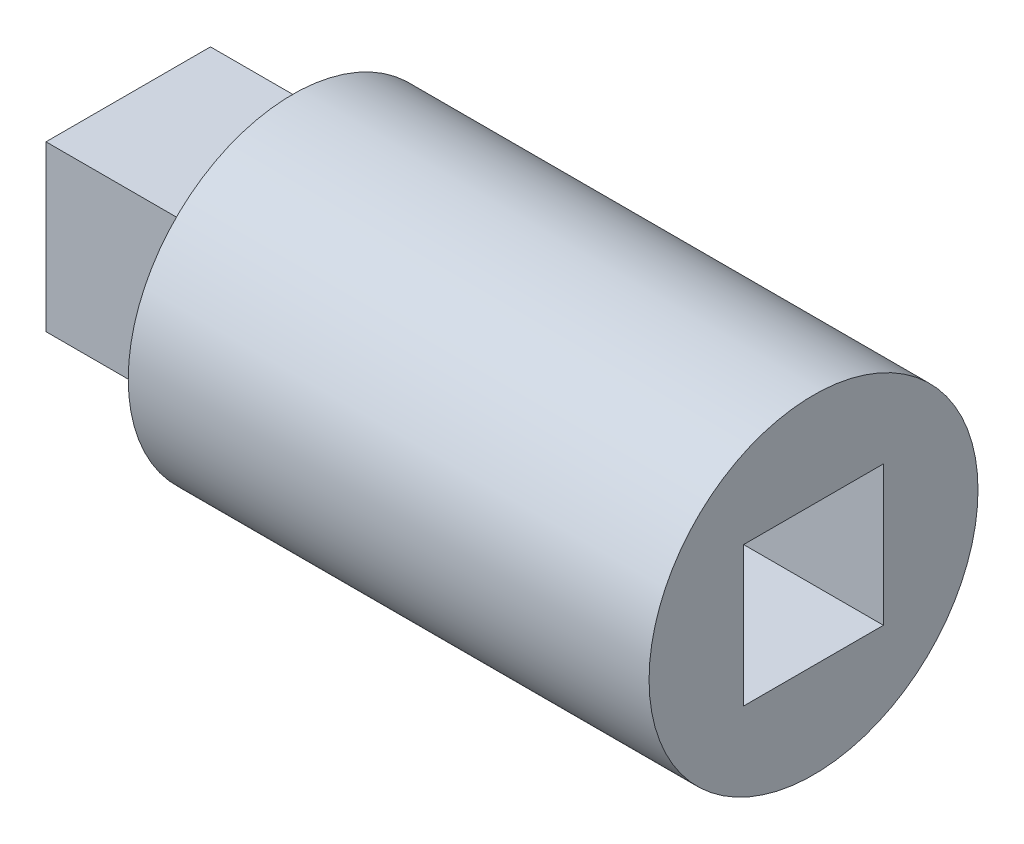
ISO-10303-21;
HEADER;
FILE_DESCRIPTION(('STEP AP214'),'2;1');
FILE_NAME('part.step','',(''),(''),'','','');
FILE_SCHEMA(('AUTOMOTIVE_DESIGN { 1 0 10303 214 1 1 1 1 }'));
ENDSEC;
DATA;
#1=APPLICATION_CONTEXT('core data for automotive mechanical design processes');
#2=APPLICATION_PROTOCOL_DEFINITION('international standard','automotive_design',2000,#1);
#3=PRODUCT_CONTEXT('',#1,'mechanical');
#4=PRODUCT('Part','Part','',(#3));
#5=PRODUCT_RELATED_PRODUCT_CATEGORY('part','',(#4));
#6=PRODUCT_DEFINITION_FORMATION('','',#4);
#7=PRODUCT_DEFINITION_CONTEXT('part definition',#1,'design');
#8=PRODUCT_DEFINITION('design','',#6,#7);
#9=PRODUCT_DEFINITION_SHAPE('','',#8);
#10=(LENGTH_UNIT() NAMED_UNIT(*) SI_UNIT(.MILLI.,.METRE.));
#11=(NAMED_UNIT(*) PLANE_ANGLE_UNIT() SI_UNIT($,.RADIAN.));
#12=(NAMED_UNIT(*) SI_UNIT($,.STERADIAN.) SOLID_ANGLE_UNIT());
#13=UNCERTAINTY_MEASURE_WITH_UNIT(LENGTH_MEASURE(1.E-05),#10,'distance_accuracy_value','');
#14=(GEOMETRIC_REPRESENTATION_CONTEXT(3) GLOBAL_UNCERTAINTY_ASSIGNED_CONTEXT((#13)) GLOBAL_UNIT_ASSIGNED_CONTEXT((#10,
#11,#12)) REPRESENTATION_CONTEXT('',''));
#15=CARTESIAN_POINT('',(0.,0.,0.));
#16=DIRECTION('',(0.,0.,1.));
#17=DIRECTION('',(1.,0.,0.));
#18=AXIS2_PLACEMENT_3D('',#15,#16,#17);
#19=CARTESIAN_POINT('',(0.,7.46105683511078,4.67299499253285));
#20=DIRECTION('',(-1.,0.,0.));
#21=DIRECTION('',(0.,0.,1.));
#22=AXIS2_PLACEMENT_3D('',#19,#20,#21);
#23=PLANE('',#22);
#24=DIRECTION('',(0.,0.,1.));
#25=VECTOR('',#24,1.);
#26=CARTESIAN_POINT('',(0.,2.55,2.55));
#27=LINE('',#26,#25);
#28=CARTESIAN_POINT('',(0.,2.55,-2.55));
#29=VERTEX_POINT('',#28);
#30=CARTESIAN_POINT('',(0.,2.55,2.55));
#31=VERTEX_POINT('',#30);
#32=EDGE_CURVE('E125',#29,#31,#27,.T.);
#33=ORIENTED_EDGE('',*,*,#32,.F.);
#34=DIRECTION('',(0.,1.,0.));
#35=VECTOR('',#34,1.);
#36=CARTESIAN_POINT('',(0.,-2.55,-2.55));
#37=LINE('',#36,#35);
#38=CARTESIAN_POINT('',(0.,-2.55,-2.55));
#39=VERTEX_POINT('',#38);
#40=EDGE_CURVE('E46',#39,#29,#37,.T.);
#41=ORIENTED_EDGE('',*,*,#40,.F.);
#42=DIRECTION('',(0.,0.,-1.));
#43=VECTOR('',#42,1.);
#44=CARTESIAN_POINT('',(0.,-2.55,2.55));
#45=LINE('',#44,#43);
#46=CARTESIAN_POINT('',(0.,-2.55,2.55));
#47=VERTEX_POINT('',#46);
#48=EDGE_CURVE('E116',#47,#39,#45,.T.);
#49=ORIENTED_EDGE('',*,*,#48,.F.);
#50=DIRECTION('',(0.,-1.,0.));
#51=VECTOR('',#50,1.);
#52=CARTESIAN_POINT('',(0.,-2.55,2.55));
#53=LINE('',#52,#51);
#54=EDGE_CURVE('E119',#31,#47,#53,.T.);
#55=ORIENTED_EDGE('',*,*,#54,.F.);
#56=EDGE_LOOP('',(#33,#41,#49,#55));
#57=FACE_BOUND('',#56,.T.);
#58=CARTESIAN_POINT('',(0.,0.,0.));
#59=DIRECTION('',(1.,0.,0.));
#60=DIRECTION('',(0.,0.,-1.));
#61=AXIS2_PLACEMENT_3D('',#58,#59,#60);
#62=CIRCLE('',#61,6.);
#63=CARTESIAN_POINT('',(0.,0.,-6.));
#64=VERTEX_POINT('',#63);
#65=EDGE_CURVE('E11',#64,#64,#62,.F.);
#66=ORIENTED_EDGE('',*,*,#65,.F.);
#67=EDGE_LOOP('',(#66));
#68=FACE_BOUND('',#67,.T.);
#69=ADVANCED_FACE('F32',(#57,#68),#23,.F.);
#70=CARTESIAN_POINT('',(-25.,0.,0.));
#71=DIRECTION('',(1.,0.,0.));
#72=DIRECTION('',(0.,0.,-1.));
#73=AXIS2_PLACEMENT_3D('',#70,#71,#72);
#74=PLANE('',#73);
#75=DIRECTION('',(0.,1.,0.));
#76=VECTOR('',#75,1.);
#77=CARTESIAN_POINT('',(-25.,-3.,3.));
#78=LINE('',#77,#76);
#79=CARTESIAN_POINT('',(-25.,-3.,3.));
#80=VERTEX_POINT('',#79);
#81=CARTESIAN_POINT('',(-25.,3.,3.));
#82=VERTEX_POINT('',#81);
#83=EDGE_CURVE('E144',#80,#82,#78,.T.);
#84=ORIENTED_EDGE('',*,*,#83,.T.);
#85=DIRECTION('',(0.,0.,-1.));
#86=VECTOR('',#85,1.);
#87=CARTESIAN_POINT('',(-25.,3.,-3.));
#88=LINE('',#87,#86);
#89=CARTESIAN_POINT('',(-25.,3.,-3.));
#90=VERTEX_POINT('',#89);
#91=EDGE_CURVE('E147',#82,#90,#88,.T.);
#92=ORIENTED_EDGE('',*,*,#91,.T.);
#93=DIRECTION('',(0.,-1.,0.));
#94=VECTOR('',#93,1.);
#95=CARTESIAN_POINT('',(-25.,-3.,-3.));
#96=LINE('',#95,#94);
#97=CARTESIAN_POINT('',(-25.,-3.,-3.));
#98=VERTEX_POINT('',#97);
#99=EDGE_CURVE('E149',#90,#98,#96,.T.);
#100=ORIENTED_EDGE('',*,*,#99,.T.);
#101=DIRECTION('',(0.,0.,1.));
#102=VECTOR('',#101,1.);
#103=CARTESIAN_POINT('',(-25.,-3.,-3.));
#104=LINE('',#103,#102);
#105=EDGE_CURVE('E151',#98,#80,#104,.T.);
#106=ORIENTED_EDGE('',*,*,#105,.T.);
#107=EDGE_LOOP('',(#84,#92,#100,#106));
#108=FACE_BOUND('',#107,.T.);
#109=ADVANCED_FACE('F174',(#108),#74,.F.);
#110=CARTESIAN_POINT('',(-25.,3.,-3.));
#111=DIRECTION('',(0.,-1.,0.));
#112=DIRECTION('',(0.,0.,-1.));
#113=AXIS2_PLACEMENT_3D('',#110,#111,#112);
#114=PLANE('',#113);
#115=DIRECTION('',(1.,0.,0.));
#116=VECTOR('',#115,1.);
#117=CARTESIAN_POINT('',(-25.,3.,3.));
#118=LINE('',#117,#116);
#119=CARTESIAN_POINT('',(-19.,3.,3.));
#120=VERTEX_POINT('',#119);
#121=EDGE_CURVE('E162',#82,#120,#118,.T.);
#122=ORIENTED_EDGE('',*,*,#121,.T.);
#123=DIRECTION('',(0.,0.,-1.));
#124=VECTOR('',#123,1.);
#125=CARTESIAN_POINT('',(-19.,3.,-3.));
#126=LINE('',#125,#124);
#127=CARTESIAN_POINT('',(-19.,3.,-3.));
#128=VERTEX_POINT('',#127);
#129=EDGE_CURVE('E140',#120,#128,#126,.T.);
#130=ORIENTED_EDGE('',*,*,#129,.T.);
#131=DIRECTION('',(1.,0.,0.));
#132=VECTOR('',#131,1.);
#133=CARTESIAN_POINT('',(-25.,3.,-3.));
#134=LINE('',#133,#132);
#135=EDGE_CURVE('E159',#90,#128,#134,.T.);
#136=ORIENTED_EDGE('',*,*,#135,.F.);
#137=ORIENTED_EDGE('',*,*,#91,.F.);
#138=EDGE_LOOP('',(#122,#130,#136,#137));
#139=FACE_BOUND('',#138,.T.);
#140=ADVANCED_FACE('F181',(#139),#114,.F.);
#141=CARTESIAN_POINT('',(-25.,-3.,-3.));
#142=DIRECTION('',(0.,0.,1.));
#143=DIRECTION('',(1.,0.,0.));
#144=AXIS2_PLACEMENT_3D('',#141,#142,#143);
#145=PLANE('',#144);
#146=ORIENTED_EDGE('',*,*,#135,.T.);
#147=DIRECTION('',(0.,-1.,0.));
#148=VECTOR('',#147,1.);
#149=CARTESIAN_POINT('',(-19.,-3.,-3.));
#150=LINE('',#149,#148);
#151=CARTESIAN_POINT('',(-19.,-3.,-3.));
#152=VERTEX_POINT('',#151);
#153=EDGE_CURVE('E137',#128,#152,#150,.T.);
#154=ORIENTED_EDGE('',*,*,#153,.T.);
#155=DIRECTION('',(1.,0.,0.));
#156=VECTOR('',#155,1.);
#157=CARTESIAN_POINT('',(-25.,-3.,-3.));
#158=LINE('',#157,#156);
#159=EDGE_CURVE('E156',#98,#152,#158,.T.);
#160=ORIENTED_EDGE('',*,*,#159,.F.);
#161=ORIENTED_EDGE('',*,*,#99,.F.);
#162=EDGE_LOOP('',(#146,#154,#160,#161));
#163=FACE_BOUND('',#162,.T.);
#164=ADVANCED_FACE('F178',(#163),#145,.F.);
#165=CARTESIAN_POINT('',(-25.,-3.,-3.));
#166=DIRECTION('',(0.,1.,0.));
#167=DIRECTION('',(0.,0.,1.));
#168=AXIS2_PLACEMENT_3D('',#165,#166,#167);
#169=PLANE('',#168);
#170=ORIENTED_EDGE('',*,*,#159,.T.);
#171=DIRECTION('',(0.,0.,1.));
#172=VECTOR('',#171,1.);
#173=CARTESIAN_POINT('',(-19.,-3.,-3.));
#174=LINE('',#173,#172);
#175=CARTESIAN_POINT('',(-19.,-3.,3.));
#176=VERTEX_POINT('',#175);
#177=EDGE_CURVE('E39',#152,#176,#174,.T.);
#178=ORIENTED_EDGE('',*,*,#177,.T.);
#179=DIRECTION('',(1.,0.,0.));
#180=VECTOR('',#179,1.);
#181=CARTESIAN_POINT('',(-25.,-3.,3.));
#182=LINE('',#181,#180);
#183=EDGE_CURVE('E153',#80,#176,#182,.T.);
#184=ORIENTED_EDGE('',*,*,#183,.F.);
#185=ORIENTED_EDGE('',*,*,#105,.F.);
#186=EDGE_LOOP('',(#170,#178,#184,#185));
#187=FACE_BOUND('',#186,.T.);
#188=ADVANCED_FACE('F166',(#187),#169,.F.);
#189=CARTESIAN_POINT('',(-25.,-3.,3.));
#190=DIRECTION('',(0.,0.,-1.));
#191=DIRECTION('',(-1.,0.,0.));
#192=AXIS2_PLACEMENT_3D('',#189,#190,#191);
#193=PLANE('',#192);
#194=ORIENTED_EDGE('',*,*,#183,.T.);
#195=DIRECTION('',(0.,1.,0.));
#196=VECTOR('',#195,1.);
#197=CARTESIAN_POINT('',(-19.,-3.,3.));
#198=LINE('',#197,#196);
#199=EDGE_CURVE('E54',#176,#120,#198,.T.);
#200=ORIENTED_EDGE('',*,*,#199,.T.);
#201=ORIENTED_EDGE('',*,*,#121,.F.);
#202=ORIENTED_EDGE('',*,*,#83,.F.);
#203=EDGE_LOOP('',(#194,#200,#201,#202));
#204=FACE_BOUND('',#203,.T.);
#205=ADVANCED_FACE('F171',(#204),#193,.F.);
#206=CARTESIAN_POINT('',(-19.,0.,0.));
#207=DIRECTION('',(-1.,0.,0.));
#208=DIRECTION('',(0.,0.,1.));
#209=AXIS2_PLACEMENT_3D('',#206,#207,#208);
#210=PLANE('',#209);
#211=CARTESIAN_POINT('',(-19.,0.,0.));
#212=DIRECTION('',(-1.,0.,0.));
#213=DIRECTION('',(0.,0.,1.));
#214=AXIS2_PLACEMENT_3D('',#211,#212,#213);
#215=CIRCLE('',#214,6.);
#216=CARTESIAN_POINT('',(-19.,0.,6.));
#217=VERTEX_POINT('',#216);
#218=EDGE_CURVE('E131',#217,#217,#215,.T.);
#219=ORIENTED_EDGE('',*,*,#218,.T.);
#220=EDGE_LOOP('',(#219));
#221=FACE_BOUND('',#220,.T.);
#222=ORIENTED_EDGE('',*,*,#199,.F.);
#223=ORIENTED_EDGE('',*,*,#177,.F.);
#224=ORIENTED_EDGE('',*,*,#153,.F.);
#225=ORIENTED_EDGE('',*,*,#129,.F.);
#226=EDGE_LOOP('',(#222,#223,#224,#225));
#227=FACE_BOUND('',#226,.T.);
#228=ADVANCED_FACE('F179',(#221,#227),#210,.T.);
#229=CARTESIAN_POINT('',(-19.,0.,0.));
#230=DIRECTION('',(1.,0.,0.));
#231=DIRECTION('',(0.,0.,-1.));
#232=AXIS2_PLACEMENT_3D('',#229,#230,#231);
#233=CYLINDRICAL_SURFACE('',#232,6.);
#234=ORIENTED_EDGE('',*,*,#218,.F.);
#235=EDGE_LOOP('',(#234));
#236=FACE_BOUND('',#235,.T.);
#237=ORIENTED_EDGE('',*,*,#65,.T.);
#238=EDGE_LOOP('',(#237));
#239=FACE_BOUND('',#238,.T.);
#240=ADVANCED_FACE('F192',(#236,#239),#233,.T.);
#241=CARTESIAN_POINT('',(-7.,-2.55,-2.55));
#242=DIRECTION('',(0.,0.,-1.));
#243=DIRECTION('',(-1.,0.,0.));
#244=AXIS2_PLACEMENT_3D('',#241,#242,#243);
#245=PLANE('',#244);
#246=ORIENTED_EDGE('',*,*,#40,.T.);
#247=DIRECTION('',(1.,0.,0.));
#248=VECTOR('',#247,1.);
#249=CARTESIAN_POINT('',(-7.,2.55,-2.55));
#250=LINE('',#249,#248);
#251=CARTESIAN_POINT('',(-7.,2.55,-2.55));
#252=VERTEX_POINT('',#251);
#253=EDGE_CURVE('E94',#252,#29,#250,.T.);
#254=ORIENTED_EDGE('',*,*,#253,.F.);
#255=DIRECTION('',(0.,1.,0.));
#256=VECTOR('',#255,1.);
#257=CARTESIAN_POINT('',(-7.,-2.55,-2.55));
#258=LINE('',#257,#256);
#259=CARTESIAN_POINT('',(-7.,-2.55,-2.55));
#260=VERTEX_POINT('',#259);
#261=EDGE_CURVE('E98',#260,#252,#258,.T.);
#262=ORIENTED_EDGE('',*,*,#261,.F.);
#263=DIRECTION('',(1.,0.,0.));
#264=VECTOR('',#263,1.);
#265=CARTESIAN_POINT('',(-7.,-2.55,-2.55));
#266=LINE('',#265,#264);
#267=EDGE_CURVE('E129',#260,#39,#266,.T.);
#268=ORIENTED_EDGE('',*,*,#267,.T.);
#269=EDGE_LOOP('',(#246,#254,#262,#268));
#270=FACE_BOUND('',#269,.T.);
#271=ADVANCED_FACE('F96',(#270),#245,.F.);
#272=CARTESIAN_POINT('',(-7.,-2.55,2.55));
#273=DIRECTION('',(0.,-1.,0.));
#274=DIRECTION('',(0.,0.,-1.));
#275=AXIS2_PLACEMENT_3D('',#272,#273,#274);
#276=PLANE('',#275);
#277=ORIENTED_EDGE('',*,*,#48,.T.);
#278=ORIENTED_EDGE('',*,*,#267,.F.);
#279=DIRECTION('',(0.,0.,-1.));
#280=VECTOR('',#279,1.);
#281=CARTESIAN_POINT('',(-7.,-2.55,2.55));
#282=LINE('',#281,#280);
#283=CARTESIAN_POINT('',(-7.,-2.55,2.55));
#284=VERTEX_POINT('',#283);
#285=EDGE_CURVE('E104',#284,#260,#282,.T.);
#286=ORIENTED_EDGE('',*,*,#285,.F.);
#287=DIRECTION('',(1.,0.,0.));
#288=VECTOR('',#287,1.);
#289=CARTESIAN_POINT('',(-7.,-2.55,2.55));
#290=LINE('',#289,#288);
#291=EDGE_CURVE('E132',#284,#47,#290,.T.);
#292=ORIENTED_EDGE('',*,*,#291,.T.);
#293=EDGE_LOOP('',(#277,#278,#286,#292));
#294=FACE_BOUND('',#293,.T.);
#295=ADVANCED_FACE('F203',(#294),#276,.F.);
#296=CARTESIAN_POINT('',(-7.,-2.55,2.55));
#297=DIRECTION('',(0.,0.,1.));
#298=DIRECTION('',(1.,0.,0.));
#299=AXIS2_PLACEMENT_3D('',#296,#297,#298);
#300=PLANE('',#299);
#301=ORIENTED_EDGE('',*,*,#54,.T.);
#302=ORIENTED_EDGE('',*,*,#291,.F.);
#303=DIRECTION('',(0.,-1.,0.));
#304=VECTOR('',#303,1.);
#305=CARTESIAN_POINT('',(-7.,-2.55,2.55));
#306=LINE('',#305,#304);
#307=CARTESIAN_POINT('',(-7.,2.55,2.55));
#308=VERTEX_POINT('',#307);
#309=EDGE_CURVE('E112',#308,#284,#306,.T.);
#310=ORIENTED_EDGE('',*,*,#309,.F.);
#311=DIRECTION('',(1.,0.,0.));
#312=VECTOR('',#311,1.);
#313=CARTESIAN_POINT('',(-7.,2.55,2.55));
#314=LINE('',#313,#312);
#315=EDGE_CURVE('E103',#308,#31,#314,.T.);
#316=ORIENTED_EDGE('',*,*,#315,.T.);
#317=EDGE_LOOP('',(#301,#302,#310,#316));
#318=FACE_BOUND('',#317,.T.);
#319=ADVANCED_FACE('F240',(#318),#300,.F.);
#320=CARTESIAN_POINT('',(-7.,2.55,2.55));
#321=DIRECTION('',(0.,1.,0.));
#322=DIRECTION('',(0.,0.,1.));
#323=AXIS2_PLACEMENT_3D('',#320,#321,#322);
#324=PLANE('',#323);
#325=ORIENTED_EDGE('',*,*,#32,.T.);
#326=ORIENTED_EDGE('',*,*,#315,.F.);
#327=DIRECTION('',(0.,0.,1.));
#328=VECTOR('',#327,1.);
#329=CARTESIAN_POINT('',(-7.,2.55,2.55));
#330=LINE('',#329,#328);
#331=EDGE_CURVE('E107',#252,#308,#330,.T.);
#332=ORIENTED_EDGE('',*,*,#331,.F.);
#333=ORIENTED_EDGE('',*,*,#253,.T.);
#334=EDGE_LOOP('',(#325,#326,#332,#333));
#335=FACE_BOUND('',#334,.T.);
#336=ADVANCED_FACE('F108',(#335),#324,.F.);
#337=CARTESIAN_POINT('',(-7.,0.,0.));
#338=DIRECTION('',(-1.,0.,0.));
#339=DIRECTION('',(0.,0.,1.));
#340=AXIS2_PLACEMENT_3D('',#337,#338,#339);
#341=PLANE('',#340);
#342=ORIENTED_EDGE('',*,*,#261,.T.);
#343=ORIENTED_EDGE('',*,*,#331,.T.);
#344=ORIENTED_EDGE('',*,*,#309,.T.);
#345=ORIENTED_EDGE('',*,*,#285,.T.);
#346=EDGE_LOOP('',(#342,#343,#344,#345));
#347=FACE_BOUND('',#346,.T.);
#348=ADVANCED_FACE('F114',(#347),#341,.F.);
#349=CLOSED_SHELL('',(#69,#109,#140,#164,#188,#205,#228,#240,#271,#295,#319,#336,#348));
#350=MANIFOLD_SOLID_BREP('B2',#349);
#351=ADVANCED_BREP_SHAPE_REPRESENTATION('',(#18,#350),#14);
#352=SHAPE_DEFINITION_REPRESENTATION(#9,#351);
ENDSEC;
END-ISO-10303-21;
